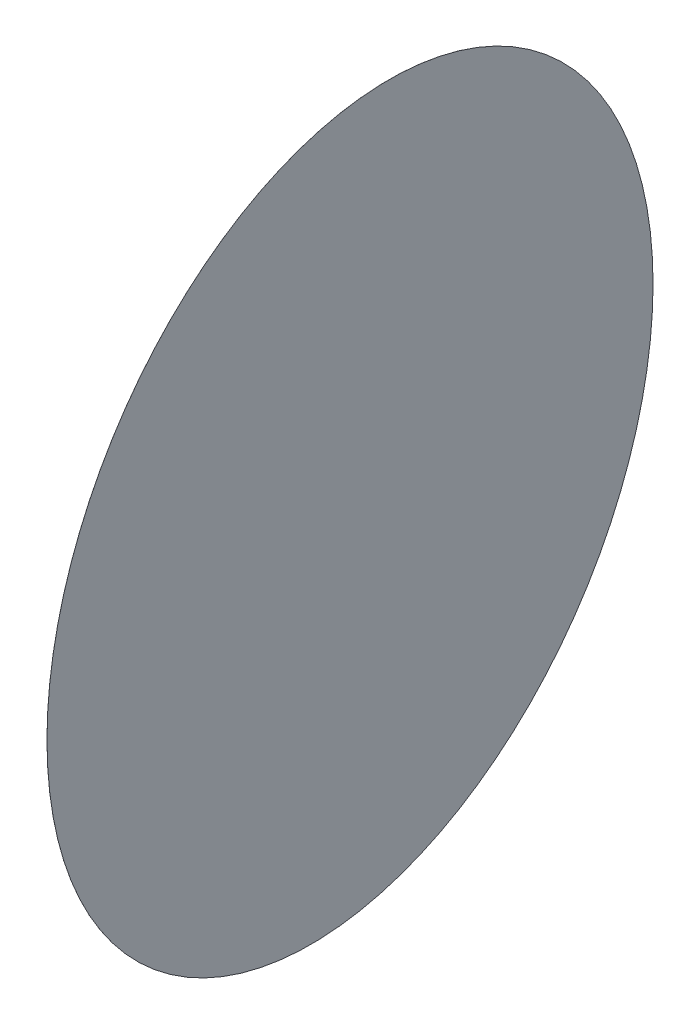
ISO-10303-21;
HEADER;
FILE_DESCRIPTION(('STEP AP214'),'2;1');
FILE_NAME('part.step','',(''),(''),'','','');
FILE_SCHEMA(('AUTOMOTIVE_DESIGN { 1 0 10303 214 1 1 1 1 }'));
ENDSEC;
DATA;
#1=APPLICATION_CONTEXT('core data for automotive mechanical design processes');
#2=APPLICATION_PROTOCOL_DEFINITION('international standard','automotive_design',2000,#1);
#3=PRODUCT_CONTEXT('',#1,'mechanical');
#4=PRODUCT('Part','Part','',(#3));
#5=PRODUCT_RELATED_PRODUCT_CATEGORY('part','',(#4));
#6=PRODUCT_DEFINITION_FORMATION('','',#4);
#7=PRODUCT_DEFINITION_CONTEXT('part definition',#1,'design');
#8=PRODUCT_DEFINITION('design','',#6,#7);
#9=PRODUCT_DEFINITION_SHAPE('','',#8);
#10=(LENGTH_UNIT() NAMED_UNIT(*) SI_UNIT(.MILLI.,.METRE.));
#11=(NAMED_UNIT(*) PLANE_ANGLE_UNIT() SI_UNIT($,.RADIAN.));
#12=(NAMED_UNIT(*) SI_UNIT($,.STERADIAN.) SOLID_ANGLE_UNIT());
#13=UNCERTAINTY_MEASURE_WITH_UNIT(LENGTH_MEASURE(1.E-05),#10,'distance_accuracy_value','');
#14=(GEOMETRIC_REPRESENTATION_CONTEXT(3) GLOBAL_UNCERTAINTY_ASSIGNED_CONTEXT((#13)) GLOBAL_UNIT_ASSIGNED_CONTEXT((#10,
#11,#12)) REPRESENTATION_CONTEXT('',''));
#15=CARTESIAN_POINT('',(0.,0.,0.));
#16=DIRECTION('',(0.,0.,1.));
#17=DIRECTION('',(1.,0.,0.));
#18=AXIS2_PLACEMENT_3D('',#15,#16,#17);
#19=CARTESIAN_POINT('',(39.6587858998138,0.,-5.2211782149943));
#20=DIRECTION('',(-0.99144486137381,0.,0.130526192220052));
#21=DIRECTION('',(0.130526192220052,0.,0.99144486137381));
#22=AXIS2_PLACEMENT_3D('',#19,#20,#21);
#23=CYLINDRICAL_SURFACE('',#22,15.);
#24=CARTESIAN_POINT('',(39.6587858998138,0.,-5.2211782149943));
#25=DIRECTION('',(-0.99144486137381,0.,0.130526192220052));
#26=DIRECTION('',(0.130526192220052,0.,0.99144486137381));
#27=AXIS2_PLACEMENT_3D('',#24,#25,#26);
#28=CIRCLE('',#27,15.);
#29=CARTESIAN_POINT('',(41.6166787831146,0.,9.65049470561283));
#30=VERTEX_POINT('',#29);
#31=EDGE_CURVE('E10',#30,#30,#28,.T.);
#32=ORIENTED_EDGE('',*,*,#31,.T.);
#33=EDGE_LOOP('',(#32));
#34=FACE_BOUND('',#33,.T.);
#35=CARTESIAN_POINT('',(39.6577944549524,0.,-5.22104768880208));
#36=DIRECTION('',(-0.99144486137381,0.,0.130526192220052));
#37=DIRECTION('',(0.130526192220052,0.,0.99144486137381));
#38=AXIS2_PLACEMENT_3D('',#35,#36,#37);
#39=CIRCLE('',#38,15.);
#40=CARTESIAN_POINT('',(41.6156873382532,0.,9.65062523180505));
#41=VERTEX_POINT('',#40);
#42=EDGE_CURVE('E39',#41,#41,#39,.T.);
#43=ORIENTED_EDGE('',*,*,#42,.F.);
#44=EDGE_LOOP('',(#43));
#45=FACE_BOUND('',#44,.T.);
#46=ADVANCED_FACE('F36',(#34,#45),#23,.T.);
#47=CARTESIAN_POINT('',(39.6587858998138,0.,-5.2211782149943));
#48=DIRECTION('',(-0.99144486137381,0.,0.130526192220052));
#49=DIRECTION('',(0.130526192220052,0.,0.99144486137381));
#50=AXIS2_PLACEMENT_3D('',#47,#48,#49);
#51=PLANE('',#50);
#52=ORIENTED_EDGE('',*,*,#31,.F.);
#53=EDGE_LOOP('',(#52));
#54=FACE_BOUND('',#53,.T.);
#55=ADVANCED_FACE('F51',(#54),#51,.F.);
#56=CARTESIAN_POINT('',(39.6577944549524,0.,-5.22104768880208));
#57=DIRECTION('',(-0.99144486137381,0.,0.130526192220052));
#58=DIRECTION('',(0.130526192220052,0.,0.99144486137381));
#59=AXIS2_PLACEMENT_3D('',#56,#57,#58);
#60=PLANE('',#59);
#61=ORIENTED_EDGE('',*,*,#42,.T.);
#62=EDGE_LOOP('',(#61));
#63=FACE_BOUND('',#62,.T.);
#64=ADVANCED_FACE('F48',(#63),#60,.T.);
#65=CLOSED_SHELL('',(#46,#55,#64));
#66=MANIFOLD_SOLID_BREP('B2',#65);
#67=ADVANCED_BREP_SHAPE_REPRESENTATION('',(#18,#66),#14);
#68=SHAPE_DEFINITION_REPRESENTATION(#9,#67);
ENDSEC;
END-ISO-10303-21;
